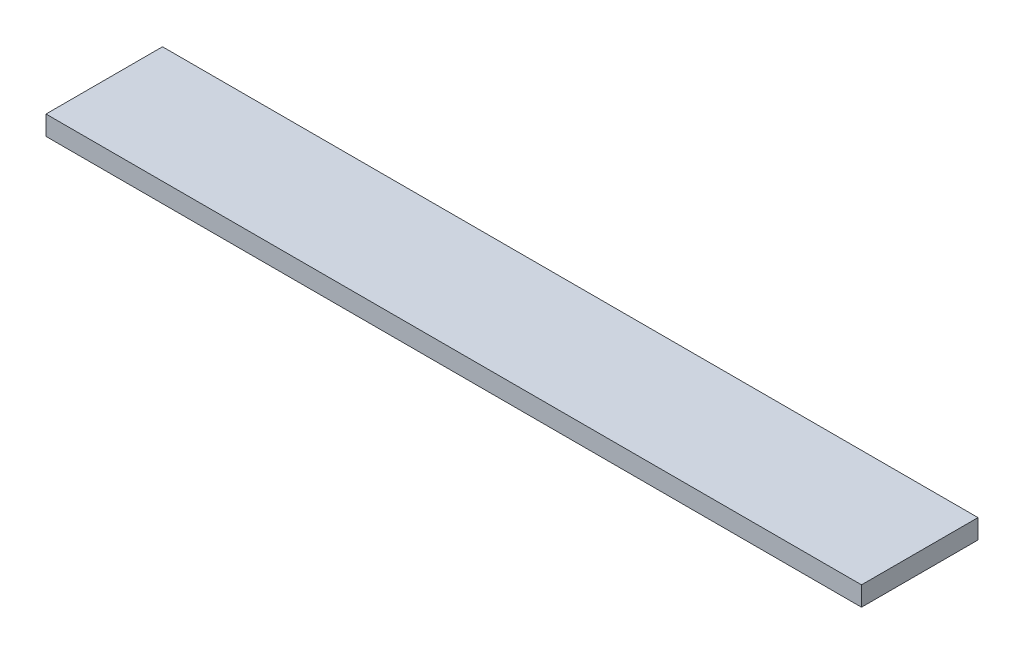
ISO-10303-21;
HEADER;
FILE_DESCRIPTION(('STEP AP214'),'2;1');
FILE_NAME('part.step','',(''),(''),'','','');
FILE_SCHEMA(('AUTOMOTIVE_DESIGN { 1 0 10303 214 1 1 1 1 }'));
ENDSEC;
DATA;
#1=APPLICATION_CONTEXT('core data for automotive mechanical design processes');
#2=APPLICATION_PROTOCOL_DEFINITION('international standard','automotive_design',2000,#1);
#3=PRODUCT_CONTEXT('',#1,'mechanical');
#4=PRODUCT('Part','Part','',(#3));
#5=PRODUCT_RELATED_PRODUCT_CATEGORY('part','',(#4));
#6=PRODUCT_DEFINITION_FORMATION('','',#4);
#7=PRODUCT_DEFINITION_CONTEXT('part definition',#1,'design');
#8=PRODUCT_DEFINITION('design','',#6,#7);
#9=PRODUCT_DEFINITION_SHAPE('','',#8);
#10=(LENGTH_UNIT() NAMED_UNIT(*) SI_UNIT(.MILLI.,.METRE.));
#11=(NAMED_UNIT(*) PLANE_ANGLE_UNIT() SI_UNIT($,.RADIAN.));
#12=(NAMED_UNIT(*) SI_UNIT($,.STERADIAN.) SOLID_ANGLE_UNIT());
#13=UNCERTAINTY_MEASURE_WITH_UNIT(LENGTH_MEASURE(1.E-05),#10,'distance_accuracy_value','');
#14=(GEOMETRIC_REPRESENTATION_CONTEXT(3) GLOBAL_UNCERTAINTY_ASSIGNED_CONTEXT((#13)) GLOBAL_UNIT_ASSIGNED_CONTEXT((#10,
#11,#12)) REPRESENTATION_CONTEXT('',''));
#15=CARTESIAN_POINT('',(0.,0.,0.));
#16=DIRECTION('',(0.,0.,1.));
#17=DIRECTION('',(1.,0.,0.));
#18=AXIS2_PLACEMENT_3D('',#15,#16,#17);
#19=CARTESIAN_POINT('',(-62.1655259579846,12.7,-41.036232022827));
#20=DIRECTION('',(1.,0.,0.));
#21=DIRECTION('',(0.,0.,-1.));
#22=AXIS2_PLACEMENT_3D('',#19,#20,#21);
#23=PLANE('',#22);
#24=DIRECTION('',(0.,0.,1.));
#25=VECTOR('',#24,1.);
#26=CARTESIAN_POINT('',(-62.1655259579846,0.,-41.036232022827));
#27=LINE('',#26,#25);
#28=CARTESIAN_POINT('',(-62.1655259579846,0.,-41.036232022827));
#29=VERTEX_POINT('',#28);
#30=CARTESIAN_POINT('',(-62.1655259579846,0.,35.1637679771731));
#31=VERTEX_POINT('',#30);
#32=EDGE_CURVE('E80',#29,#31,#27,.T.);
#33=ORIENTED_EDGE('',*,*,#32,.T.);
#34=DIRECTION('',(0.,-1.,0.));
#35=VECTOR('',#34,1.);
#36=CARTESIAN_POINT('',(-62.1655259579846,12.7,35.1637679771731));
#37=LINE('',#36,#35);
#38=CARTESIAN_POINT('',(-62.1655259579846,12.7,35.1637679771731));
#39=VERTEX_POINT('',#38);
#40=EDGE_CURVE('E11',#39,#31,#37,.T.);
#41=ORIENTED_EDGE('',*,*,#40,.F.);
#42=DIRECTION('',(0.,0.,1.));
#43=VECTOR('',#42,1.);
#44=CARTESIAN_POINT('',(-62.1655259579846,12.7,-41.036232022827));
#45=LINE('',#44,#43);
#46=CARTESIAN_POINT('',(-62.1655259579846,12.7,-41.036232022827));
#47=VERTEX_POINT('',#46);
#48=EDGE_CURVE('E68',#47,#39,#45,.T.);
#49=ORIENTED_EDGE('',*,*,#48,.F.);
#50=DIRECTION('',(0.,-1.,0.));
#51=VECTOR('',#50,1.);
#52=CARTESIAN_POINT('',(-62.1655259579846,12.7,-41.036232022827));
#53=LINE('',#52,#51);
#54=EDGE_CURVE('E76',#47,#29,#53,.T.);
#55=ORIENTED_EDGE('',*,*,#54,.T.);
#56=EDGE_LOOP('',(#33,#41,#49,#55));
#57=FACE_BOUND('',#56,.T.);
#58=ADVANCED_FACE('F17',(#57),#23,.F.);
#59=CARTESIAN_POINT('',(-62.1655259579846,12.7,35.1637679771731));
#60=DIRECTION('',(0.,0.,-1.));
#61=DIRECTION('',(-1.,0.,0.));
#62=AXIS2_PLACEMENT_3D('',#59,#60,#61);
#63=PLANE('',#62);
#64=DIRECTION('',(1.,0.,0.));
#65=VECTOR('',#64,1.);
#66=CARTESIAN_POINT('',(-62.1655259579846,0.,35.1637679771731));
#67=LINE('',#66,#65);
#68=CARTESIAN_POINT('',(471.234474042015,0.,35.1637679771731));
#69=VERTEX_POINT('',#68);
#70=EDGE_CURVE('E72',#31,#69,#67,.T.);
#71=ORIENTED_EDGE('',*,*,#70,.T.);
#72=DIRECTION('',(0.,-1.,0.));
#73=VECTOR('',#72,1.);
#74=CARTESIAN_POINT('',(471.234474042015,12.7,35.1637679771731));
#75=LINE('',#74,#73);
#76=CARTESIAN_POINT('',(471.234474042015,12.7,35.1637679771731));
#77=VERTEX_POINT('',#76);
#78=EDGE_CURVE('E25',#77,#69,#75,.T.);
#79=ORIENTED_EDGE('',*,*,#78,.F.);
#80=DIRECTION('',(1.,0.,0.));
#81=VECTOR('',#80,1.);
#82=CARTESIAN_POINT('',(-62.1655259579846,12.7,35.1637679771731));
#83=LINE('',#82,#81);
#84=EDGE_CURVE('E63',#39,#77,#83,.T.);
#85=ORIENTED_EDGE('',*,*,#84,.F.);
#86=ORIENTED_EDGE('',*,*,#40,.T.);
#87=EDGE_LOOP('',(#71,#79,#85,#86));
#88=FACE_BOUND('',#87,.T.);
#89=ADVANCED_FACE('F71',(#88),#63,.F.);
#90=CARTESIAN_POINT('',(471.234474042015,12.7,-41.036232022827));
#91=DIRECTION('',(-1.,0.,0.));
#92=DIRECTION('',(0.,0.,1.));
#93=AXIS2_PLACEMENT_3D('',#90,#91,#92);
#94=PLANE('',#93);
#95=DIRECTION('',(0.,0.,-1.));
#96=VECTOR('',#95,1.);
#97=CARTESIAN_POINT('',(471.234474042015,0.,-41.036232022827));
#98=LINE('',#97,#96);
#99=CARTESIAN_POINT('',(471.234474042015,0.,-41.036232022827));
#100=VERTEX_POINT('',#99);
#101=EDGE_CURVE('E50',#69,#100,#98,.T.);
#102=ORIENTED_EDGE('',*,*,#101,.T.);
#103=DIRECTION('',(0.,-1.,0.));
#104=VECTOR('',#103,1.);
#105=CARTESIAN_POINT('',(471.234474042015,12.7,-41.036232022827));
#106=LINE('',#105,#104);
#107=CARTESIAN_POINT('',(471.234474042015,12.7,-41.036232022827));
#108=VERTEX_POINT('',#107);
#109=EDGE_CURVE('E73',#108,#100,#106,.T.);
#110=ORIENTED_EDGE('',*,*,#109,.F.);
#111=DIRECTION('',(0.,0.,-1.));
#112=VECTOR('',#111,1.);
#113=CARTESIAN_POINT('',(471.234474042015,12.7,-41.036232022827));
#114=LINE('',#113,#112);
#115=EDGE_CURVE('E66',#77,#108,#114,.T.);
#116=ORIENTED_EDGE('',*,*,#115,.F.);
#117=ORIENTED_EDGE('',*,*,#78,.T.);
#118=EDGE_LOOP('',(#102,#110,#116,#117));
#119=FACE_BOUND('',#118,.T.);
#120=ADVANCED_FACE('F74',(#119),#94,.F.);
#121=CARTESIAN_POINT('',(-62.1655259579846,12.7,-41.036232022827));
#122=DIRECTION('',(0.,0.,1.));
#123=DIRECTION('',(1.,0.,0.));
#124=AXIS2_PLACEMENT_3D('',#121,#122,#123);
#125=PLANE('',#124);
#126=DIRECTION('',(-1.,0.,0.));
#127=VECTOR('',#126,1.);
#128=CARTESIAN_POINT('',(-62.1655259579846,0.,-41.036232022827));
#129=LINE('',#128,#127);
#130=EDGE_CURVE('E56',#100,#29,#129,.T.);
#131=ORIENTED_EDGE('',*,*,#130,.T.);
#132=ORIENTED_EDGE('',*,*,#54,.F.);
#133=DIRECTION('',(-1.,0.,0.));
#134=VECTOR('',#133,1.);
#135=CARTESIAN_POINT('',(-62.1655259579846,12.7,-41.036232022827));
#136=LINE('',#135,#134);
#137=EDGE_CURVE('E33',#108,#47,#136,.T.);
#138=ORIENTED_EDGE('',*,*,#137,.F.);
#139=ORIENTED_EDGE('',*,*,#109,.T.);
#140=EDGE_LOOP('',(#131,#132,#138,#139));
#141=FACE_BOUND('',#140,.T.);
#142=ADVANCED_FACE('F87',(#141),#125,.F.);
#143=CARTESIAN_POINT('',(0.,12.7,0.));
#144=DIRECTION('',(0.,1.,0.));
#145=DIRECTION('',(0.,0.,1.));
#146=AXIS2_PLACEMENT_3D('',#143,#144,#145);
#147=PLANE('',#146);
#148=ORIENTED_EDGE('',*,*,#48,.T.);
#149=ORIENTED_EDGE('',*,*,#84,.T.);
#150=ORIENTED_EDGE('',*,*,#115,.T.);
#151=ORIENTED_EDGE('',*,*,#137,.T.);
#152=EDGE_LOOP('',(#148,#149,#150,#151));
#153=FACE_BOUND('',#152,.T.);
#154=ADVANCED_FACE('F64',(#153),#147,.T.);
#155=CARTESIAN_POINT('',(0.,0.,0.));
#156=DIRECTION('',(0.,1.,0.));
#157=DIRECTION('',(0.,0.,1.));
#158=AXIS2_PLACEMENT_3D('',#155,#156,#157);
#159=PLANE('',#158);
#160=ORIENTED_EDGE('',*,*,#32,.F.);
#161=ORIENTED_EDGE('',*,*,#130,.F.);
#162=ORIENTED_EDGE('',*,*,#101,.F.);
#163=ORIENTED_EDGE('',*,*,#70,.F.);
#164=EDGE_LOOP('',(#160,#161,#162,#163));
#165=FACE_BOUND('',#164,.T.);
#166=ADVANCED_FACE('F90',(#165),#159,.F.);
#167=CLOSED_SHELL('',(#58,#89,#120,#142,#154,#166));
#168=MANIFOLD_SOLID_BREP('B1',#167);
#169=ADVANCED_BREP_SHAPE_REPRESENTATION('',(#18,#168),#14);
#170=SHAPE_DEFINITION_REPRESENTATION(#9,#169);
ENDSEC;
END-ISO-10303-21;
